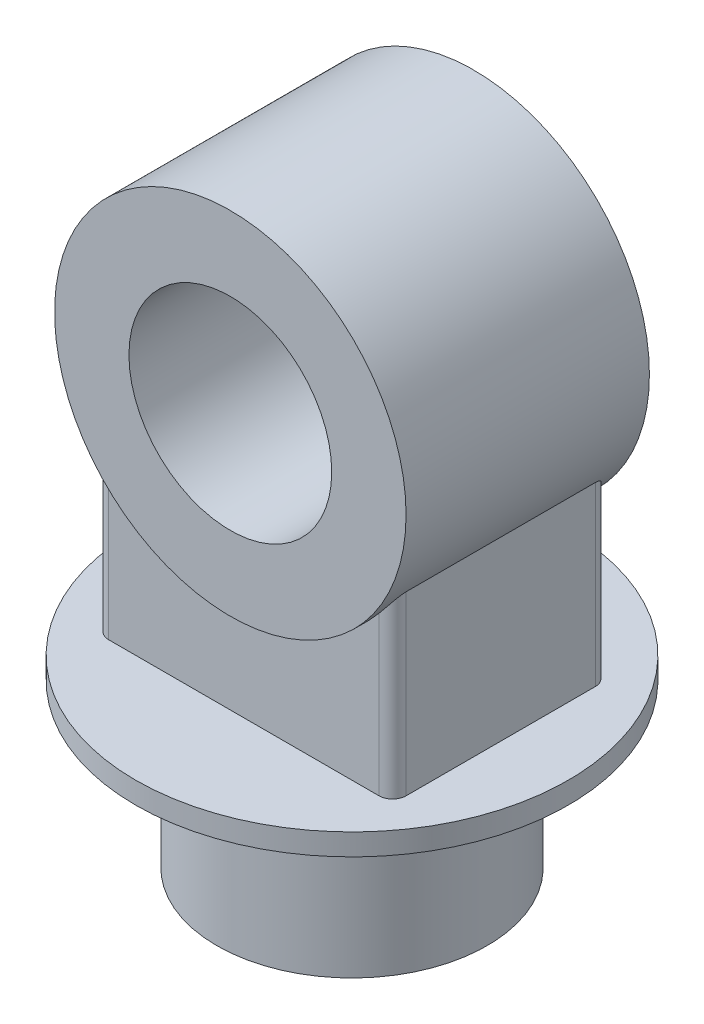
ISO-10303-21;
HEADER;
FILE_DESCRIPTION(('STEP AP214'),'2;1');
FILE_NAME('part.step','',(''),(''),'','','');
FILE_SCHEMA(('AUTOMOTIVE_DESIGN { 1 0 10303 214 1 1 1 1 }'));
ENDSEC;
DATA;
#1=APPLICATION_CONTEXT('core data for automotive mechanical design processes');
#2=APPLICATION_PROTOCOL_DEFINITION('international standard','automotive_design',2000,#1);
#3=PRODUCT_CONTEXT('',#1,'mechanical');
#4=PRODUCT('Part','Part','',(#3));
#5=PRODUCT_RELATED_PRODUCT_CATEGORY('part','',(#4));
#6=PRODUCT_DEFINITION_FORMATION('','',#4);
#7=PRODUCT_DEFINITION_CONTEXT('part definition',#1,'design');
#8=PRODUCT_DEFINITION('design','',#6,#7);
#9=PRODUCT_DEFINITION_SHAPE('','',#8);
#10=(LENGTH_UNIT() NAMED_UNIT(*) SI_UNIT(.MILLI.,.METRE.));
#11=(NAMED_UNIT(*) PLANE_ANGLE_UNIT() SI_UNIT($,.RADIAN.));
#12=(NAMED_UNIT(*) SI_UNIT($,.STERADIAN.) SOLID_ANGLE_UNIT());
#13=UNCERTAINTY_MEASURE_WITH_UNIT(LENGTH_MEASURE(1.E-05),#10,'distance_accuracy_value','');
#14=(GEOMETRIC_REPRESENTATION_CONTEXT(3) GLOBAL_UNCERTAINTY_ASSIGNED_CONTEXT((#13)) GLOBAL_UNIT_ASSIGNED_CONTEXT((#10,
#11,#12)) REPRESENTATION_CONTEXT('',''));
#15=CARTESIAN_POINT('',(0.,0.,0.));
#16=DIRECTION('',(0.,0.,1.));
#17=DIRECTION('',(1.,0.,0.));
#18=AXIS2_PLACEMENT_3D('',#15,#16,#17);
#19=CARTESIAN_POINT('',(0.,120.,0.));
#20=DIRECTION('',(0.,-1.,0.));
#21=DIRECTION('',(0.,0.,-1.));
#22=AXIS2_PLACEMENT_3D('',#19,#20,#21);
#23=CYLINDRICAL_SURFACE('',#22,100.);
#24=CARTESIAN_POINT('',(0.,120.,0.));
#25=DIRECTION('',(0.,1.,0.));
#26=DIRECTION('',(0.,0.,1.));
#27=AXIS2_PLACEMENT_3D('',#24,#25,#26);
#28=CIRCLE('',#27,100.);
#29=CARTESIAN_POINT('',(0.,120.,100.));
#30=VERTEX_POINT('',#29);
#31=EDGE_CURVE('E151',#30,#30,#28,.T.);
#32=ORIENTED_EDGE('',*,*,#31,.F.);
#33=EDGE_LOOP('',(#32));
#34=FACE_BOUND('',#33,.T.);
#35=CARTESIAN_POINT('',(0.,0.,0.));
#36=DIRECTION('',(0.,1.,0.));
#37=DIRECTION('',(0.,0.,1.));
#38=AXIS2_PLACEMENT_3D('',#35,#36,#37);
#39=CIRCLE('',#38,100.);
#40=CARTESIAN_POINT('',(0.,0.,100.));
#41=VERTEX_POINT('',#40);
#42=EDGE_CURVE('E236',#41,#41,#39,.T.);
#43=ORIENTED_EDGE('',*,*,#42,.T.);
#44=EDGE_LOOP('',(#43));
#45=FACE_BOUND('',#44,.T.);
#46=ADVANCED_FACE('F42',(#34,#45),#23,.T.);
#47=CARTESIAN_POINT('',(0.,0.,0.));
#48=DIRECTION('',(0.,1.,0.));
#49=DIRECTION('',(0.,0.,1.));
#50=AXIS2_PLACEMENT_3D('',#47,#48,#49);
#51=PLANE('',#50);
#52=ORIENTED_EDGE('',*,*,#42,.F.);
#53=EDGE_LOOP('',(#52));
#54=FACE_BOUND('',#53,.T.);
#55=ADVANCED_FACE('F247',(#54),#51,.F.);
#56=CARTESIAN_POINT('',(0.,136.,0.));
#57=DIRECTION('',(0.,-1.,0.));
#58=DIRECTION('',(0.,0.,-1.));
#59=AXIS2_PLACEMENT_3D('',#56,#57,#58);
#60=CYLINDRICAL_SURFACE('',#59,160.);
#61=CARTESIAN_POINT('',(0.,136.,0.));
#62=DIRECTION('',(0.,1.,0.));
#63=DIRECTION('',(0.,0.,1.));
#64=AXIS2_PLACEMENT_3D('',#61,#62,#63);
#65=CIRCLE('',#64,160.);
#66=CARTESIAN_POINT('',(0.,136.,160.));
#67=VERTEX_POINT('',#66);
#68=EDGE_CURVE('E232',#67,#67,#65,.T.);
#69=ORIENTED_EDGE('',*,*,#68,.F.);
#70=EDGE_LOOP('',(#69));
#71=FACE_BOUND('',#70,.T.);
#72=CARTESIAN_POINT('',(0.,120.,0.));
#73=DIRECTION('',(0.,1.,0.));
#74=DIRECTION('',(0.,0.,1.));
#75=AXIS2_PLACEMENT_3D('',#72,#73,#74);
#76=CIRCLE('',#75,160.);
#77=CARTESIAN_POINT('',(0.,120.,160.));
#78=VERTEX_POINT('',#77);
#79=EDGE_CURVE('E227',#78,#78,#76,.T.);
#80=ORIENTED_EDGE('',*,*,#79,.T.);
#81=EDGE_LOOP('',(#80));
#82=FACE_BOUND('',#81,.T.);
#83=ADVANCED_FACE('F249',(#71,#82),#60,.T.);
#84=CARTESIAN_POINT('',(0.,136.,0.));
#85=DIRECTION('',(0.,1.,0.));
#86=DIRECTION('',(0.,0.,1.));
#87=AXIS2_PLACEMENT_3D('',#84,#85,#86);
#88=PLANE('',#87);
#89=DIRECTION('',(0.,0.,1.));
#90=VECTOR('',#89,1.);
#91=CARTESIAN_POINT('',(-110.,136.,80.));
#92=LINE('',#91,#90);
#93=CARTESIAN_POINT('',(-110.,136.,-70.));
#94=VERTEX_POINT('',#93);
#95=CARTESIAN_POINT('',(-110.,136.,70.));
#96=VERTEX_POINT('',#95);
#97=EDGE_CURVE('E416',#94,#96,#92,.T.);
#98=ORIENTED_EDGE('',*,*,#97,.F.);
#99=CARTESIAN_POINT('',(-100.,136.,-70.));
#100=DIRECTION('',(0.,1.,0.));
#101=DIRECTION('',(0.,0.,1.));
#102=AXIS2_PLACEMENT_3D('',#99,#100,#101);
#103=CIRCLE('',#102,10.);
#104=CARTESIAN_POINT('',(-100.,136.,-80.));
#105=VERTEX_POINT('',#104);
#106=EDGE_CURVE('E127',#94,#105,#103,.F.);
#107=ORIENTED_EDGE('',*,*,#106,.T.);
#108=DIRECTION('',(-1.,0.,0.));
#109=VECTOR('',#108,1.);
#110=CARTESIAN_POINT('',(110.,136.,-80.));
#111=LINE('',#110,#109);
#112=CARTESIAN_POINT('',(100.,136.,-80.));
#113=VERTEX_POINT('',#112);
#114=EDGE_CURVE('E413',#113,#105,#111,.T.);
#115=ORIENTED_EDGE('',*,*,#114,.F.);
#116=CARTESIAN_POINT('',(100.,136.,-70.));
#117=DIRECTION('',(0.,1.,0.));
#118=DIRECTION('',(0.,0.,1.));
#119=AXIS2_PLACEMENT_3D('',#116,#117,#118);
#120=CIRCLE('',#119,10.);
#121=CARTESIAN_POINT('',(110.,136.,-70.));
#122=VERTEX_POINT('',#121);
#123=EDGE_CURVE('E64',#113,#122,#120,.F.);
#124=ORIENTED_EDGE('',*,*,#123,.T.);
#125=DIRECTION('',(0.,0.,-1.));
#126=VECTOR('',#125,1.);
#127=CARTESIAN_POINT('',(110.,136.,80.));
#128=LINE('',#127,#126);
#129=CARTESIAN_POINT('',(110.,136.,70.));
#130=VERTEX_POINT('',#129);
#131=EDGE_CURVE('E213',#130,#122,#128,.T.);
#132=ORIENTED_EDGE('',*,*,#131,.F.);
#133=CARTESIAN_POINT('',(100.,136.,70.));
#134=DIRECTION('',(0.,1.,0.));
#135=DIRECTION('',(0.,0.,1.));
#136=AXIS2_PLACEMENT_3D('',#133,#134,#135);
#137=CIRCLE('',#136,10.);
#138=CARTESIAN_POINT('',(100.,136.,80.));
#139=VERTEX_POINT('',#138);
#140=EDGE_CURVE('E57',#130,#139,#137,.F.);
#141=ORIENTED_EDGE('',*,*,#140,.T.);
#142=DIRECTION('',(1.,0.,0.));
#143=VECTOR('',#142,1.);
#144=CARTESIAN_POINT('',(110.,136.,80.));
#145=LINE('',#144,#143);
#146=CARTESIAN_POINT('',(-100.,136.,80.));
#147=VERTEX_POINT('',#146);
#148=EDGE_CURVE('E212',#147,#139,#145,.T.);
#149=ORIENTED_EDGE('',*,*,#148,.F.);
#150=CARTESIAN_POINT('',(-100.,136.,70.));
#151=DIRECTION('',(0.,1.,0.));
#152=DIRECTION('',(0.,0.,1.));
#153=AXIS2_PLACEMENT_3D('',#150,#151,#152);
#154=CIRCLE('',#153,10.);
#155=EDGE_CURVE('E128',#147,#96,#154,.F.);
#156=ORIENTED_EDGE('',*,*,#155,.T.);
#157=EDGE_LOOP('',(#98,#107,#115,#124,#132,#141,#149,#156));
#158=FACE_BOUND('',#157,.T.);
#159=ORIENTED_EDGE('',*,*,#68,.T.);
#160=EDGE_LOOP('',(#159));
#161=FACE_BOUND('',#160,.T.);
#162=ADVANCED_FACE('F210',(#158,#161),#88,.T.);
#163=CARTESIAN_POINT('',(0.,120.,0.));
#164=DIRECTION('',(0.,1.,0.));
#165=DIRECTION('',(0.,0.,1.));
#166=AXIS2_PLACEMENT_3D('',#163,#164,#165);
#167=PLANE('',#166);
#168=ORIENTED_EDGE('',*,*,#31,.T.);
#169=EDGE_LOOP('',(#168));
#170=FACE_BOUND('',#169,.T.);
#171=ORIENTED_EDGE('',*,*,#79,.F.);
#172=EDGE_LOOP('',(#171));
#173=FACE_BOUND('',#172,.T.);
#174=ADVANCED_FACE('F258',(#170,#173),#167,.F.);
#175=CARTESIAN_POINT('',(110.,466.002,80.));
#176=DIRECTION('',(0.,0.,-1.));
#177=DIRECTION('',(-1.,0.,0.));
#178=AXIS2_PLACEMENT_3D('',#175,#176,#177);
#179=PLANE('',#178);
#180=CARTESIAN_POINT('',(0.,336.,80.));
#181=DIRECTION('',(0.,0.,-1.));
#182=DIRECTION('',(-1.,0.,0.));
#183=AXIS2_PLACEMENT_3D('',#180,#181,#182);
#184=CIRCLE('',#183,130.);
#185=CARTESIAN_POINT('',(-100.,252.933761370819,80.));
#186=VERTEX_POINT('',#185);
#187=CARTESIAN_POINT('',(100.,252.933761370819,80.));
#188=VERTEX_POINT('',#187);
#189=EDGE_CURVE('E119',#186,#188,#184,.F.);
#190=ORIENTED_EDGE('',*,*,#189,.F.);
#191=DIRECTION('',(0.,-1.,0.));
#192=VECTOR('',#191,1.);
#193=CARTESIAN_POINT('',(-100.,466.002,80.));
#194=LINE('',#193,#192);
#195=EDGE_CURVE('E134',#186,#147,#194,.T.);
#196=ORIENTED_EDGE('',*,*,#195,.T.);
#197=ORIENTED_EDGE('',*,*,#148,.T.);
#198=DIRECTION('',(0.,-1.,0.));
#199=VECTOR('',#198,1.);
#200=CARTESIAN_POINT('',(100.,466.002,80.));
#201=LINE('',#200,#199);
#202=EDGE_CURVE('E136',#139,#188,#201,.F.);
#203=ORIENTED_EDGE('',*,*,#202,.T.);
#204=EDGE_LOOP('',(#190,#196,#197,#203));
#205=FACE_BOUND('',#204,.T.);
#206=ADVANCED_FACE('F132',(#205),#179,.F.);
#207=CARTESIAN_POINT('',(-110.,466.002,80.));
#208=DIRECTION('',(1.,0.,0.));
#209=DIRECTION('',(0.,0.,-1.));
#210=AXIS2_PLACEMENT_3D('',#207,#208,#209);
#211=PLANE('',#210);
#212=ORIENTED_EDGE('',*,*,#97,.T.);
#213=DIRECTION('',(0.,-1.,0.));
#214=VECTOR('',#213,1.);
#215=CARTESIAN_POINT('',(-110.,466.002,70.));
#216=LINE('',#215,#214);
#217=CARTESIAN_POINT('',(-110.,266.717967697245,70.));
#218=VERTEX_POINT('',#217);
#219=EDGE_CURVE('E148',#96,#218,#216,.F.);
#220=ORIENTED_EDGE('',*,*,#219,.T.);
#221=DIRECTION('',(0.,0.,-1.));
#222=VECTOR('',#221,1.);
#223=CARTESIAN_POINT('',(-110.,266.717967697245,90.));
#224=LINE('',#223,#222);
#225=CARTESIAN_POINT('',(-110.,266.717967697245,-70.));
#226=VERTEX_POINT('',#225);
#227=EDGE_CURVE('E122',#226,#218,#224,.F.);
#228=ORIENTED_EDGE('',*,*,#227,.F.);
#229=DIRECTION('',(0.,-1.,0.));
#230=VECTOR('',#229,1.);
#231=CARTESIAN_POINT('',(-110.,466.002,-70.));
#232=LINE('',#231,#230);
#233=EDGE_CURVE('E142',#226,#94,#232,.T.);
#234=ORIENTED_EDGE('',*,*,#233,.T.);
#235=EDGE_LOOP('',(#212,#220,#228,#234));
#236=FACE_BOUND('',#235,.T.);
#237=ADVANCED_FACE('F264',(#236),#211,.F.);
#238=CARTESIAN_POINT('',(110.,466.002,80.));
#239=DIRECTION('',(-1.,0.,0.));
#240=DIRECTION('',(0.,0.,1.));
#241=AXIS2_PLACEMENT_3D('',#238,#239,#240);
#242=PLANE('',#241);
#243=ORIENTED_EDGE('',*,*,#131,.T.);
#244=DIRECTION('',(0.,-1.,0.));
#245=VECTOR('',#244,1.);
#246=CARTESIAN_POINT('',(110.,466.002,-70.));
#247=LINE('',#246,#245);
#248=CARTESIAN_POINT('',(110.,266.717967697245,-70.));
#249=VERTEX_POINT('',#248);
#250=EDGE_CURVE('E167',#122,#249,#247,.F.);
#251=ORIENTED_EDGE('',*,*,#250,.T.);
#252=DIRECTION('',(0.,0.,-1.));
#253=VECTOR('',#252,1.);
#254=CARTESIAN_POINT('',(110.,266.717967697245,90.));
#255=LINE('',#254,#253);
#256=CARTESIAN_POINT('',(110.,266.717967697245,70.));
#257=VERTEX_POINT('',#256);
#258=EDGE_CURVE('E138',#257,#249,#255,.T.);
#259=ORIENTED_EDGE('',*,*,#258,.F.);
#260=DIRECTION('',(0.,-1.,0.));
#261=VECTOR('',#260,1.);
#262=CARTESIAN_POINT('',(110.,466.002,70.));
#263=LINE('',#262,#261);
#264=EDGE_CURVE('E164',#257,#130,#263,.T.);
#265=ORIENTED_EDGE('',*,*,#264,.T.);
#266=EDGE_LOOP('',(#243,#251,#259,#265));
#267=FACE_BOUND('',#266,.T.);
#268=ADVANCED_FACE('F220',(#267),#242,.F.);
#269=CARTESIAN_POINT('',(110.,466.002,-80.));
#270=DIRECTION('',(0.,0.,1.));
#271=DIRECTION('',(1.,0.,0.));
#272=AXIS2_PLACEMENT_3D('',#269,#270,#271);
#273=PLANE('',#272);
#274=ORIENTED_EDGE('',*,*,#114,.T.);
#275=DIRECTION('',(0.,-1.,0.));
#276=VECTOR('',#275,1.);
#277=CARTESIAN_POINT('',(-100.,466.002,-80.));
#278=LINE('',#277,#276);
#279=CARTESIAN_POINT('',(-100.,252.933761370819,-80.));
#280=VERTEX_POINT('',#279);
#281=EDGE_CURVE('E161',#105,#280,#278,.F.);
#282=ORIENTED_EDGE('',*,*,#281,.T.);
#283=CARTESIAN_POINT('',(0.,336.,-80.));
#284=DIRECTION('',(0.,0.,1.));
#285=DIRECTION('',(1.,0.,0.));
#286=AXIS2_PLACEMENT_3D('',#283,#284,#285);
#287=CIRCLE('',#286,130.);
#288=CARTESIAN_POINT('',(100.,252.933761370819,-80.));
#289=VERTEX_POINT('',#288);
#290=EDGE_CURVE('E223',#289,#280,#287,.F.);
#291=ORIENTED_EDGE('',*,*,#290,.F.);
#292=DIRECTION('',(0.,-1.,0.));
#293=VECTOR('',#292,1.);
#294=CARTESIAN_POINT('',(100.,466.002,-80.));
#295=LINE('',#294,#293);
#296=EDGE_CURVE('E157',#289,#113,#295,.T.);
#297=ORIENTED_EDGE('',*,*,#296,.T.);
#298=EDGE_LOOP('',(#274,#282,#291,#297));
#299=FACE_BOUND('',#298,.T.);
#300=ADVANCED_FACE('F268',(#299),#273,.F.);
#301=CARTESIAN_POINT('',(0.,336.,90.));
#302=DIRECTION('',(0.,0.,-1.));
#303=DIRECTION('',(-1.,0.,0.));
#304=AXIS2_PLACEMENT_3D('',#301,#302,#303);
#305=CYLINDRICAL_SURFACE('',#304,130.);
#306=CARTESIAN_POINT('',(0.,336.,90.));
#307=DIRECTION('',(0.,0.,1.));
#308=DIRECTION('',(1.,0.,0.));
#309=AXIS2_PLACEMENT_3D('',#306,#307,#308);
#310=CIRCLE('',#309,130.);
#311=CARTESIAN_POINT('',(130.,336.,90.));
#312=VERTEX_POINT('',#311);
#313=EDGE_CURVE('E417',#312,#312,#310,.T.);
#314=ORIENTED_EDGE('',*,*,#313,.F.);
#315=EDGE_LOOP('',(#314));
#316=FACE_BOUND('',#315,.T.);
#317=CARTESIAN_POINT('',(0.,336.,-90.));
#318=DIRECTION('',(0.,0.,1.));
#319=DIRECTION('',(1.,0.,0.));
#320=AXIS2_PLACEMENT_3D('',#317,#318,#319);
#321=CIRCLE('',#320,130.);
#322=CARTESIAN_POINT('',(130.,336.,-90.));
#323=VERTEX_POINT('',#322);
#324=EDGE_CURVE('E423',#323,#323,#321,.T.);
#325=ORIENTED_EDGE('',*,*,#324,.T.);
#326=EDGE_LOOP('',(#325));
#327=FACE_BOUND('',#326,.T.);
#328=ORIENTED_EDGE('',*,*,#290,.T.);
#329=CARTESIAN_POINT('',(-100.,252.933761370819,-80.));
#330=CARTESIAN_POINT('',(-100.223611151915,253.202952503255,-79.9999830665315));
#331=CARTESIAN_POINT('',(-100.446118360057,253.473036166024,-79.9924995885085));
#332=CARTESIAN_POINT('',(-100.888548742496,254.014496760122,-79.9629173131463));
#333=CARTESIAN_POINT('',(-101.108472043759,254.285873626978,-79.9408192370116));
#334=CARTESIAN_POINT('',(-101.545586290072,254.829711400373,-79.8822979337703));
#335=CARTESIAN_POINT('',(-101.76277446753,255.102173087004,-79.8458612385231));
#336=CARTESIAN_POINT('',(-102.193849033468,255.647413797012,-79.7588609087488));
#337=CARTESIAN_POINT('',(-102.407735374993,255.920192824843,-79.7082970735217));
#338=CARTESIAN_POINT('',(-103.048408055095,256.74400885936,-79.5343891784366));
#339=CARTESIAN_POINT('',(-103.469748368072,257.294974230618,-79.3894263280958));
#340=CARTESIAN_POINT('',(-104.088382224678,258.117224843771,-79.1288060997197));
#341=CARTESIAN_POINT('',(-104.292337034927,258.39057162742,-79.0347525474724));
#342=CARTESIAN_POINT('',(-104.695498702643,258.935304765081,-78.8319429710982));
#343=CARTESIAN_POINT('',(-104.894706004332,259.206691300842,-78.7231883289499));
#344=CARTESIAN_POINT('',(-105.336170271764,259.812965668139,-78.4620472638272));
#345=CARTESIAN_POINT('',(-105.577006541077,260.147108038148,-78.3055009036513));
#346=CARTESIAN_POINT('',(-106.04966094987,260.809343252621,-77.967808626391));
#347=CARTESIAN_POINT('',(-106.281479043935,261.137436066616,-77.7866625854444));
#348=CARTESIAN_POINT('',(-106.734152264033,261.784259610706,-77.3986376161628));
#349=CARTESIAN_POINT('',(-106.955036134368,262.103013877598,-77.1918317878757));
#350=CARTESIAN_POINT('',(-107.384708325122,262.728803605627,-76.749894392022));
#351=CARTESIAN_POINT('',(-107.593501627276,263.035843875289,-76.5147746155492));
#352=CARTESIAN_POINT('',(-107.921279015409,263.522080966667,-76.1068757916446));
#353=CARTESIAN_POINT('',(-108.044709884718,263.706240813682,-75.9435605188263));
#354=CARTESIAN_POINT('',(-108.284949666933,264.066582834907,-75.6038296157538));
#355=CARTESIAN_POINT('',(-108.401760304956,264.242767084986,-75.4274174262628));
#356=CARTESIAN_POINT('',(-108.627683741988,264.585236991633,-75.0605773993746));
#357=CARTESIAN_POINT('',(-108.736797961361,264.751524473746,-74.8701521613912));
#358=CARTESIAN_POINT('',(-108.945874410432,265.071634412635,-74.4745306992528));
#359=CARTESIAN_POINT('',(-109.04583974995,265.225461102935,-74.2693395369045));
#360=CARTESIAN_POINT('',(-109.274660386151,265.579056080623,-73.7536743100227));
#361=CARTESIAN_POINT('',(-109.398046362816,265.771031349643,-73.4351396850742));
#362=CARTESIAN_POINT('',(-109.561336457207,266.026263049992,-72.9345418523035));
#363=CARTESIAN_POINT('',(-109.612072269395,266.105785634321,-72.7641622498836));
#364=CARTESIAN_POINT('',(-109.705421847597,266.25239837099,-72.4160328323222));
#365=CARTESIAN_POINT('',(-109.748040656091,266.319496241142,-72.2382876769632));
#366=CARTESIAN_POINT('',(-109.820262744001,266.433384610412,-71.8947331689276));
#367=CARTESIAN_POINT('',(-109.850752312767,266.481551609067,-71.729567610939));
#368=CARTESIAN_POINT('',(-109.903691363628,266.565274678988,-71.3948451418076));
#369=CARTESIAN_POINT('',(-109.926143541964,266.600834979285,-71.2252897238033));
#370=CARTESIAN_POINT('',(-109.962659042777,266.658707696818,-70.8807814271977));
#371=CARTESIAN_POINT('',(-109.976613864032,266.680848750137,-70.7057875562757));
#372=CARTESIAN_POINT('',(-109.99061964662,266.703076138542,-70.4419386674803));
#373=CARTESIAN_POINT('',(-109.99413386492,266.708654625171,-70.3536902139711));
#374=CARTESIAN_POINT('',(-109.998824989492,266.716102079046,-70.1769662160102));
#375=CARTESIAN_POINT('',(-110.000001659485,266.717970671296,-70.088490649507));
#376=CARTESIAN_POINT('',(-110.,266.717967697245,-70.));
#377=B_SPLINE_CURVE_WITH_KNOTS('',3,(#329,#330,#331,#332,#333,#334,#335,#336,#337,#338,#339,
#340,#341,#342,#343,#344,#345,#346,#347,#348,#349,#350,#351,#352,#353,#354,#355,#356,#357,#358,
#359,#360,#361,#362,#363,#364,#365,#366,#367,#368,#369,#370,#371,#372,#373,#374,#375,#376),
.UNSPECIFIED.,.F.,.F.,(4,2,2,2,2,2,2,2,2,2,2,2,2,2,2,2,2,2,2,2,2,2,2,4),(0.,1.04974156507777,
2.09943133114568,3.1501094241726,4.20080244462026,6.32356278933854,7.38465211465329,
8.44564176134495,9.7667768553939,11.0879186017609,12.4053795382948,13.7222937149076,
14.5479419827464,15.3733741023698,16.1986534888326,17.023651302289,18.194686650492,
18.7783719827905,19.3616935243415,19.8852298594992,20.4085904030381,20.9385006934629,
21.2038887699912,21.4693036704869),.UNSPECIFIED.);
#378=EDGE_CURVE('E193',#280,#226,#377,.T.);
#379=ORIENTED_EDGE('',*,*,#378,.T.);
#380=ORIENTED_EDGE('',*,*,#227,.T.);
#381=CARTESIAN_POINT('',(-110.,266.717967697245,70.));
#382=CARTESIAN_POINT('',(-110.000033683462,266.718025852698,70.1614230595313));
#383=CARTESIAN_POINT('',(-109.996092792414,266.711764254296,70.3228118197691));
#384=CARTESIAN_POINT('',(-109.980519982779,266.687045880384,70.6441123999958));
#385=CARTESIAN_POINT('',(-109.968896213713,266.668602027069,70.8040256031146));
#386=CARTESIAN_POINT('',(-109.938376398954,266.620217986395,71.1196424551221));
#387=CARTESIAN_POINT('',(-109.919558261622,266.590400967593,71.2753727040436));
#388=CARTESIAN_POINT('',(-109.875071558334,266.52000006118,71.5834085562726));
#389=CARTESIAN_POINT('',(-109.849400846184,266.479412800404,71.7357130704249));
#390=CARTESIAN_POINT('',(-109.784772267017,266.377386983169,72.0722520040974));
#391=CARTESIAN_POINT('',(-109.744103525393,266.313281105856,72.2553511890568));
#392=CARTESIAN_POINT('',(-109.654040532803,266.17165023193,72.6141464391851));
#393=CARTESIAN_POINT('',(-109.604640075501,266.094115691273,72.7898371277865));
#394=CARTESIAN_POINT('',(-109.497968805892,265.927147418338,73.1338723913451));
#395=CARTESIAN_POINT('',(-109.440667457039,265.837667562915,73.3021849515411));
#396=CARTESIAN_POINT('',(-109.319341126161,265.648779195145,73.6304969218558));
#397=CARTESIAN_POINT('',(-109.25531768694,265.549372961282,73.7904982269664));
#398=CARTESIAN_POINT('',(-109.085069343255,265.28590129292,74.1868876463209));
#399=CARTESIAN_POINT('',(-108.974781990569,265.115997241409,74.4176642111939));
#400=CARTESIAN_POINT('',(-108.742772943656,264.76058359918,74.8607110351427));
#401=CARTESIAN_POINT('',(-108.621044869784,264.575065307649,75.072970840064));
#402=CARTESIAN_POINT('',(-108.36794946479,264.19164129378,75.4804206329535));
#403=CARTESIAN_POINT('',(-108.236568322626,263.993717884812,75.6755852518652));
#404=CARTESIAN_POINT('',(-107.965814499919,263.588382733388,76.0497203250662));
#405=CARTESIAN_POINT('',(-107.826442440892,263.380971729107,76.2286920360201));
#406=CARTESIAN_POINT('',(-107.56145650763,262.989174407744,76.5468161797372));
#407=CARTESIAN_POINT('',(-107.436764821801,262.805791987749,76.6879854690674));
#408=CARTESIAN_POINT('',(-107.182869679799,262.434497987953,76.9599552926783));
#409=CARTESIAN_POINT('',(-107.053665586411,262.24658576965,77.0907543539386));
#410=CARTESIAN_POINT('',(-106.659844344167,261.677121003612,77.4685356621902));
#411=CARTESIAN_POINT('',(-106.389102445143,261.289965080353,77.7008024816961));
#412=CARTESIAN_POINT('',(-105.833418194947,260.504836154638,78.129863631631));
#413=CARTESIAN_POINT('',(-105.548442441802,260.106838810795,78.3265689888296));
#414=CARTESIAN_POINT('',(-104.96676628824,259.304344779382,78.6860846955171));
#415=CARTESIAN_POINT('',(-104.670068038633,258.899849292081,78.8489012287858));
#416=CARTESIAN_POINT('',(-104.024574509401,258.030646711215,79.1623550419402));
#417=CARTESIAN_POINT('',(-103.674248758637,257.565348460988,79.3081944572228));
#418=CARTESIAN_POINT('',(-102.961876677953,256.632523338709,79.558756520093));
#419=CARTESIAN_POINT('',(-102.599828734006,256.16499616738,79.6634734792563));
#420=CARTESIAN_POINT('',(-102.051092736822,255.466397204689,79.7891645729388));
#421=CARTESIAN_POINT('',(-101.868137468165,255.235094848973,79.8257282191265));
#422=CARTESIAN_POINT('',(-101.499966150616,254.77288550036,79.8886289353229));
#423=CARTESIAN_POINT('',(-101.314750133026,254.541978502041,79.9149661467555));
#424=CARTESIAN_POINT('',(-100.942320486513,254.080919722901,79.9572665465168));
#425=CARTESIAN_POINT('',(-100.755107350153,253.850767773367,79.9732322353467));
#426=CARTESIAN_POINT('',(-100.378860262163,253.391449185777,79.9945948234744));
#427=CARTESIAN_POINT('',(-100.189826234412,253.162282589497,79.9999912789888));
#428=CARTESIAN_POINT('',(-100.,252.933761370819,80.));
#429=B_SPLINE_CURVE_WITH_KNOTS('',3,(#381,#382,#383,#384,#385,#386,#387,#388,#389,#390,#391,
#392,#393,#394,#395,#396,#397,#398,#399,#400,#401,#402,#403,#404,#405,#406,#407,#408,#409,#410,
#411,#412,#413,#414,#415,#416,#417,#418,#419,#420,#421,#422,#423,#424,#425,#426,#427,#428),
.UNSPECIFIED.,.F.,.F.,(4,2,2,2,2,2,2,2,2,2,2,2,2,2,2,2,2,2,2,2,2,2,2,4),(0.,0.484045005923086,
0.967577389145422,1.44601544684507,1.92460352520313,2.51835043890468,3.11252108624077,
3.70905613988741,4.30545457926274,5.22516595363374,6.14539326092329,7.06696382284191,
7.98846280401962,8.7768009200054,9.56525081419893,11.1426900482287,12.7240229357797,
14.305067020047,16.1047501551828,17.9046821508918,18.7960435003638,19.6873925225409,
20.5785265668947,21.4696980275819),.UNSPECIFIED.);
#430=EDGE_CURVE('E115',#218,#186,#429,.T.);
#431=ORIENTED_EDGE('',*,*,#430,.T.);
#432=ORIENTED_EDGE('',*,*,#189,.T.);
#433=CARTESIAN_POINT('',(100.,252.933761370819,80.));
#434=CARTESIAN_POINT('',(100.223611151915,253.202952503255,79.9999830665315));
#435=CARTESIAN_POINT('',(100.446118360057,253.473036166024,79.9924995885084));
#436=CARTESIAN_POINT('',(100.888548742496,254.014496760122,79.9629173131463));
#437=CARTESIAN_POINT('',(101.108472043759,254.285873626978,79.9408192370115));
#438=CARTESIAN_POINT('',(101.545586290072,254.829711400373,79.8822979337703));
#439=CARTESIAN_POINT('',(101.76277446753,255.102173087004,79.8458612385231));
#440=CARTESIAN_POINT('',(102.193849033468,255.647413797012,79.7588609087488));
#441=CARTESIAN_POINT('',(102.407735374993,255.920192824843,79.7082970735217));
#442=CARTESIAN_POINT('',(103.048408055095,256.74400885936,79.5343891784366));
#443=CARTESIAN_POINT('',(103.469748368072,257.294974230618,79.3894263280957));
#444=CARTESIAN_POINT('',(104.088382224678,258.117224843771,79.1288060997197));
#445=CARTESIAN_POINT('',(104.292337034927,258.39057162742,79.0347525474724));
#446=CARTESIAN_POINT('',(104.695498702643,258.935304765081,78.8319429710981));
#447=CARTESIAN_POINT('',(104.894706004332,259.206691300842,78.7231883289499));
#448=CARTESIAN_POINT('',(105.336170271764,259.812965668139,78.4620472638272));
#449=CARTESIAN_POINT('',(105.577006541077,260.147108038148,78.3055009036513));
#450=CARTESIAN_POINT('',(106.04966094987,260.809343252621,77.967808626391));
#451=CARTESIAN_POINT('',(106.281479043935,261.137436066616,77.7866625854443));
#452=CARTESIAN_POINT('',(106.734152264033,261.784259610706,77.3986376161628));
#453=CARTESIAN_POINT('',(106.955036134368,262.103013877598,77.1918317878757));
#454=CARTESIAN_POINT('',(107.384708325122,262.728803605627,76.749894392022));
#455=CARTESIAN_POINT('',(107.593501627276,263.035843875289,76.5147746155492));
#456=CARTESIAN_POINT('',(107.921279015409,263.522080966666,76.1068757916445));
#457=CARTESIAN_POINT('',(108.044709884718,263.706240813682,75.9435605188263));
#458=CARTESIAN_POINT('',(108.284949666933,264.066582834907,75.6038296157538));
#459=CARTESIAN_POINT('',(108.401760304956,264.242767084986,75.4274174262629));
#460=CARTESIAN_POINT('',(108.627683741988,264.585236991633,75.0605773993746));
#461=CARTESIAN_POINT('',(108.736797961361,264.751524473746,74.8701521613912));
#462=CARTESIAN_POINT('',(108.945874410432,265.071634412635,74.4745306992527));
#463=CARTESIAN_POINT('',(109.04583974995,265.225461102935,74.2693395369045));
#464=CARTESIAN_POINT('',(109.274660386151,265.579056080623,73.7536743100227));
#465=CARTESIAN_POINT('',(109.398046362816,265.771031349643,73.4351396850742));
#466=CARTESIAN_POINT('',(109.561336457207,266.026263049992,72.9345418523035));
#467=CARTESIAN_POINT('',(109.612072269395,266.105785634321,72.7641622498837));
#468=CARTESIAN_POINT('',(109.705421847597,266.25239837099,72.4160328323222));
#469=CARTESIAN_POINT('',(109.748040656091,266.319496241142,72.2382876769633));
#470=CARTESIAN_POINT('',(109.820262744001,266.433384610412,71.8947331689276));
#471=CARTESIAN_POINT('',(109.850752312767,266.481551609067,71.729567610939));
#472=CARTESIAN_POINT('',(109.903691363628,266.565274678987,71.3948451418076));
#473=CARTESIAN_POINT('',(109.926143541964,266.600834979285,71.2252897238033));
#474=CARTESIAN_POINT('',(109.962659042777,266.658707696818,70.8807814271977));
#475=CARTESIAN_POINT('',(109.976613864032,266.680848750137,70.7057875562757));
#476=CARTESIAN_POINT('',(109.99061964662,266.703076138542,70.4419386674803));
#477=CARTESIAN_POINT('',(109.99413386492,266.708654625171,70.3536902139711));
#478=CARTESIAN_POINT('',(109.998824989492,266.716102079046,70.1769662160102));
#479=CARTESIAN_POINT('',(110.000001659485,266.717970671296,70.088490649507));
#480=CARTESIAN_POINT('',(110.,266.717967697245,70.));
#481=B_SPLINE_CURVE_WITH_KNOTS('',3,(#433,#434,#435,#436,#437,#438,#439,#440,#441,#442,#443,
#444,#445,#446,#447,#448,#449,#450,#451,#452,#453,#454,#455,#456,#457,#458,#459,#460,#461,#462,
#463,#464,#465,#466,#467,#468,#469,#470,#471,#472,#473,#474,#475,#476,#477,#478,#479,#480),
.UNSPECIFIED.,.F.,.F.,(4,2,2,2,2,2,2,2,2,2,2,2,2,2,2,2,2,2,2,2,2,2,2,4),(0.,1.04974156507782,
2.09943133114566,3.15010942417265,4.20080244462031,6.3235627893386,7.38465211465333,
8.44564176134499,9.76677685539395,11.087918601761,12.4053795382948,13.7222937149077,
14.5479419827464,15.3733741023698,16.1986534888326,17.023651302289,18.194686650492,
18.7783719827905,19.3616935243415,19.8852298594992,20.408590403038,20.9385006934629,
21.2038887699912,21.4693036704869),.UNSPECIFIED.);
#482=EDGE_CURVE('E11',#188,#257,#481,.T.);
#483=ORIENTED_EDGE('',*,*,#482,.T.);
#484=ORIENTED_EDGE('',*,*,#258,.T.);
#485=CARTESIAN_POINT('',(110.,266.717967697245,-70.));
#486=CARTESIAN_POINT('',(110.000033683462,266.718025852698,-70.1614230595314));
#487=CARTESIAN_POINT('',(109.996092792414,266.711764254296,-70.3228118197691));
#488=CARTESIAN_POINT('',(109.980519982779,266.687045880384,-70.6441123999958));
#489=CARTESIAN_POINT('',(109.968896213713,266.668602027069,-70.8040256031146));
#490=CARTESIAN_POINT('',(109.938376398954,266.620217986395,-71.1196424551221));
#491=CARTESIAN_POINT('',(109.919558261622,266.590400967593,-71.2753727040436));
#492=CARTESIAN_POINT('',(109.875071558334,266.52000006118,-71.5834085562727));
#493=CARTESIAN_POINT('',(109.849400846184,266.479412800404,-71.735713070425));
#494=CARTESIAN_POINT('',(109.784772267017,266.377386983169,-72.0722520040975));
#495=CARTESIAN_POINT('',(109.744103525393,266.313281105856,-72.2553511890569));
#496=CARTESIAN_POINT('',(109.654040532803,266.17165023193,-72.6141464391851));
#497=CARTESIAN_POINT('',(109.604640075501,266.094115691273,-72.7898371277865));
#498=CARTESIAN_POINT('',(109.497968805892,265.927147418338,-73.1338723913451));
#499=CARTESIAN_POINT('',(109.440667457039,265.837667562915,-73.3021849515411));
#500=CARTESIAN_POINT('',(109.319341126161,265.648779195145,-73.6304969218559));
#501=CARTESIAN_POINT('',(109.25531768694,265.549372961282,-73.7904982269664));
#502=CARTESIAN_POINT('',(109.085069343255,265.28590129292,-74.1868876463209));
#503=CARTESIAN_POINT('',(108.974781990569,265.115997241409,-74.4176642111939));
#504=CARTESIAN_POINT('',(108.742772943656,264.76058359918,-74.8607110351427));
#505=CARTESIAN_POINT('',(108.621044869784,264.575065307649,-75.0729708400641));
#506=CARTESIAN_POINT('',(108.36794946479,264.19164129378,-75.4804206329535));
#507=CARTESIAN_POINT('',(108.236568322626,263.993717884812,-75.6755852518653));
#508=CARTESIAN_POINT('',(107.965814499919,263.588382733387,-76.0497203250662));
#509=CARTESIAN_POINT('',(107.826442440892,263.380971729107,-76.2286920360202));
#510=CARTESIAN_POINT('',(107.56145650763,262.989174407744,-76.5468161797373));
#511=CARTESIAN_POINT('',(107.436764821801,262.805791987749,-76.6879854690674));
#512=CARTESIAN_POINT('',(107.182869679799,262.434497987953,-76.9599552926784));
#513=CARTESIAN_POINT('',(107.053665586411,262.24658576965,-77.0907543539386));
#514=CARTESIAN_POINT('',(106.659844344167,261.677121003612,-77.4685356621902));
#515=CARTESIAN_POINT('',(106.389102445143,261.289965080353,-77.7008024816961));
#516=CARTESIAN_POINT('',(105.833418194947,260.504836154638,-78.129863631631));
#517=CARTESIAN_POINT('',(105.548442441802,260.106838810795,-78.3265689888296));
#518=CARTESIAN_POINT('',(104.96676628824,259.304344779382,-78.6860846955172));
#519=CARTESIAN_POINT('',(104.670068038633,258.899849292081,-78.8489012287859));
#520=CARTESIAN_POINT('',(104.024574509401,258.030646711215,-79.1623550419403));
#521=CARTESIAN_POINT('',(103.674248758637,257.565348460988,-79.3081944572229));
#522=CARTESIAN_POINT('',(102.961876677953,256.632523338709,-79.558756520093));
#523=CARTESIAN_POINT('',(102.599828734006,256.16499616738,-79.6634734792563));
#524=CARTESIAN_POINT('',(102.051092736822,255.466397204689,-79.7891645729388));
#525=CARTESIAN_POINT('',(101.868137468165,255.235094848973,-79.8257282191265));
#526=CARTESIAN_POINT('',(101.499966150616,254.77288550036,-79.8886289353229));
#527=CARTESIAN_POINT('',(101.314750133026,254.541978502041,-79.9149661467555));
#528=CARTESIAN_POINT('',(100.942320486513,254.080919722901,-79.9572665465168));
#529=CARTESIAN_POINT('',(100.755107350153,253.850767773367,-79.9732322353468));
#530=CARTESIAN_POINT('',(100.378860262163,253.391449185777,-79.9945948234744));
#531=CARTESIAN_POINT('',(100.189826234412,253.162282589497,-79.9999912789888));
#532=CARTESIAN_POINT('',(100.,252.933761370819,-80.));
#533=B_SPLINE_CURVE_WITH_KNOTS('',3,(#485,#486,#487,#488,#489,#490,#491,#492,#493,#494,#495,
#496,#497,#498,#499,#500,#501,#502,#503,#504,#505,#506,#507,#508,#509,#510,#511,#512,#513,#514,
#515,#516,#517,#518,#519,#520,#521,#522,#523,#524,#525,#526,#527,#528,#529,#530,#531,#532),
.UNSPECIFIED.,.F.,.F.,(4,2,2,2,2,2,2,2,2,2,2,2,2,2,2,2,2,2,2,2,2,2,2,4),(0.,0.484045005923084,
0.967577389145413,1.44601544684507,1.92460352520314,2.51835043890468,3.11252108624076,
3.70905613988741,4.30545457926273,5.22516595363372,6.14539326092331,7.06696382284195,
7.98846280401965,8.77680092000541,9.56525081419904,11.1426900482287,12.7240229357798,
14.305067020047,16.1047501551828,17.9046821508917,18.7960435003637,19.6873925225409,
20.5785265668948,21.4696980275819),.UNSPECIFIED.);
#534=EDGE_CURVE('E201',#249,#289,#533,.T.);
#535=ORIENTED_EDGE('',*,*,#534,.T.);
#536=EDGE_LOOP('',(#328,#379,#380,#431,#432,#483,#484,#535));
#537=FACE_BOUND('',#536,.T.);
#538=ADVANCED_FACE('F118',(#316,#327,#537),#305,.T.);
#539=CARTESIAN_POINT('',(0.,336.,90.));
#540=DIRECTION('',(0.,0.,1.));
#541=DIRECTION('',(1.,0.,0.));
#542=AXIS2_PLACEMENT_3D('',#539,#540,#541);
#543=PLANE('',#542);
#544=ORIENTED_EDGE('',*,*,#313,.T.);
#545=EDGE_LOOP('',(#544));
#546=FACE_BOUND('',#545,.T.);
#547=CARTESIAN_POINT('',(0.,336.,90.));
#548=DIRECTION('',(0.,0.,1.));
#549=DIRECTION('',(1.,0.,0.));
#550=AXIS2_PLACEMENT_3D('',#547,#548,#549);
#551=CIRCLE('',#550,75.);
#552=CARTESIAN_POINT('',(-75.,336.,90.));
#553=VERTEX_POINT('',#552);
#554=EDGE_CURVE('E430',#553,#553,#551,.T.);
#555=ORIENTED_EDGE('',*,*,#554,.F.);
#556=EDGE_LOOP('',(#555));
#557=FACE_BOUND('',#556,.T.);
#558=ADVANCED_FACE('F292',(#546,#557),#543,.T.);
#559=CARTESIAN_POINT('',(0.,336.,-90.));
#560=DIRECTION('',(0.,0.,1.));
#561=DIRECTION('',(1.,0.,0.));
#562=AXIS2_PLACEMENT_3D('',#559,#560,#561);
#563=PLANE('',#562);
#564=ORIENTED_EDGE('',*,*,#324,.F.);
#565=EDGE_LOOP('',(#564));
#566=FACE_BOUND('',#565,.T.);
#567=CARTESIAN_POINT('',(0.,336.,-90.));
#568=DIRECTION('',(0.,0.,1.));
#569=DIRECTION('',(1.,0.,0.));
#570=AXIS2_PLACEMENT_3D('',#567,#568,#569);
#571=CIRCLE('',#570,75.);
#572=CARTESIAN_POINT('',(-75.,336.,-90.));
#573=VERTEX_POINT('',#572);
#574=EDGE_CURVE('E432',#573,#573,#571,.T.);
#575=ORIENTED_EDGE('',*,*,#574,.T.);
#576=EDGE_LOOP('',(#575));
#577=FACE_BOUND('',#576,.T.);
#578=ADVANCED_FACE('F298',(#566,#577),#563,.F.);
#579=CARTESIAN_POINT('',(0.,336.,90.));
#580=DIRECTION('',(0.,0.,-1.));
#581=DIRECTION('',(-1.,0.,0.));
#582=AXIS2_PLACEMENT_3D('',#579,#580,#581);
#583=CYLINDRICAL_SURFACE('',#582,75.);
#584=CARTESIAN_POINT('',(-75.,336.,90.));
#585=CARTESIAN_POINT('',(-75.,336.,88.125));
#586=CARTESIAN_POINT('',(-75.,336.,86.25));
#587=CARTESIAN_POINT('',(-75.,336.,82.5));
#588=CARTESIAN_POINT('',(-75.,336.,80.625));
#589=CARTESIAN_POINT('',(-75.,336.,76.875));
#590=CARTESIAN_POINT('',(-75.,336.,75.));
#591=CARTESIAN_POINT('',(-75.,336.,71.25));
#592=CARTESIAN_POINT('',(-75.,336.,69.375));
#593=CARTESIAN_POINT('',(-75.,336.,65.625));
#594=CARTESIAN_POINT('',(-75.,336.,63.75));
#595=CARTESIAN_POINT('',(-75.,336.,60.));
#596=CARTESIAN_POINT('',(-75.,336.,58.125));
#597=CARTESIAN_POINT('',(-75.,336.,54.375));
#598=CARTESIAN_POINT('',(-75.,336.,52.5));
#599=CARTESIAN_POINT('',(-75.,336.,48.75));
#600=CARTESIAN_POINT('',(-75.,336.,46.875));
#601=CARTESIAN_POINT('',(-75.,336.,43.125));
#602=CARTESIAN_POINT('',(-75.,336.,41.25));
#603=CARTESIAN_POINT('',(-75.,336.,37.5));
#604=CARTESIAN_POINT('',(-75.,336.,35.625));
#605=CARTESIAN_POINT('',(-75.,336.,31.875));
#606=CARTESIAN_POINT('',(-75.,336.,30.));
#607=CARTESIAN_POINT('',(-75.,336.,26.25));
#608=CARTESIAN_POINT('',(-75.,336.,24.375));
#609=CARTESIAN_POINT('',(-75.,336.,20.625));
#610=CARTESIAN_POINT('',(-75.,336.,18.75));
#611=CARTESIAN_POINT('',(-75.,336.,15.));
#612=CARTESIAN_POINT('',(-75.,336.,13.125));
#613=CARTESIAN_POINT('',(-75.,336.,9.37499999999998));
#614=CARTESIAN_POINT('',(-75.,336.,7.49999999999998));
#615=CARTESIAN_POINT('',(-75.,336.,3.74999999999998));
#616=CARTESIAN_POINT('',(-75.,336.,1.87499999999997));
#617=CARTESIAN_POINT('',(-75.,336.,-1.87500000000003));
#618=CARTESIAN_POINT('',(-75.,336.,-3.75000000000003));
#619=CARTESIAN_POINT('',(-75.,336.,-7.50000000000003));
#620=CARTESIAN_POINT('',(-75.,336.,-9.37500000000004));
#621=CARTESIAN_POINT('',(-75.,336.,-13.125));
#622=CARTESIAN_POINT('',(-75.,336.,-15.));
#623=CARTESIAN_POINT('',(-75.,336.,-18.75));
#624=CARTESIAN_POINT('',(-75.,336.,-20.625));
#625=CARTESIAN_POINT('',(-75.,336.,-24.375));
#626=CARTESIAN_POINT('',(-75.,336.,-26.25));
#627=CARTESIAN_POINT('',(-75.,336.,-30.));
#628=CARTESIAN_POINT('',(-75.,336.,-31.875));
#629=CARTESIAN_POINT('',(-75.,336.,-35.625));
#630=CARTESIAN_POINT('',(-75.,336.,-37.5));
#631=CARTESIAN_POINT('',(-75.,336.,-41.25));
#632=CARTESIAN_POINT('',(-75.,336.,-43.125));
#633=CARTESIAN_POINT('',(-75.,336.,-46.875));
#634=CARTESIAN_POINT('',(-75.,336.,-48.75));
#635=CARTESIAN_POINT('',(-75.,336.,-52.5));
#636=CARTESIAN_POINT('',(-75.,336.,-54.375));
#637=CARTESIAN_POINT('',(-75.,336.,-58.125));
#638=CARTESIAN_POINT('',(-75.,336.,-60.));
#639=CARTESIAN_POINT('',(-75.,336.,-63.75));
#640=CARTESIAN_POINT('',(-75.,336.,-65.625));
#641=CARTESIAN_POINT('',(-75.,336.,-69.375));
#642=CARTESIAN_POINT('',(-75.,336.,-71.25));
#643=CARTESIAN_POINT('',(-75.,336.,-75.));
#644=CARTESIAN_POINT('',(-75.,336.,-76.875));
#645=CARTESIAN_POINT('',(-75.,336.,-80.625));
#646=CARTESIAN_POINT('',(-75.,336.,-82.5));
#647=CARTESIAN_POINT('',(-75.,336.,-86.25));
#648=CARTESIAN_POINT('',(-75.,336.,-88.125));
#649=CARTESIAN_POINT('',(-75.,336.,-90.));
#650=B_SPLINE_CURVE_WITH_KNOTS('',3,(#584,#585,#586,#587,#588,#589,#590,#591,#592,#593,#594,
#595,#596,#597,#598,#599,#600,#601,#602,#603,#604,#605,#606,#607,#608,#609,#610,#611,#612,#613,
#614,#615,#616,#617,#618,#619,#620,#621,#622,#623,#624,#625,#626,#627,#628,#629,#630,#631,#632,
#633,#634,#635,#636,#637,#638,#639,#640,#641,#642,#643,#644,#645,#646,#647,#648,#649),
.UNSPECIFIED.,.F.,.F.,(4,2,2,2,2,2,2,2,2,2,2,2,2,2,2,2,2,2,2,2,2,2,2,2,2,2,2,2,2,2,2,2,4),(0.,
5.62499999999999,11.25,16.875,22.5,28.125,33.75,39.375,45.,50.625,56.25,61.875,67.5,73.125,
78.75,84.375,90.,95.625,101.25,106.875,112.5,118.125,123.75,129.375,135.,140.625,146.25,151.875,
157.5,163.125,168.75,174.375,180.),.UNSPECIFIED.);
#651=EDGE_CURVE('BSEAM186',#553,#573,#650,.T.);
#652=ORIENTED_EDGE('',*,*,#554,.T.);
#653=ORIENTED_EDGE('',*,*,#574,.F.);
#654=ORIENTED_EDGE('',*,*,#651,.T.);
#655=ORIENTED_EDGE('',*,*,#651,.F.);
#656=EDGE_LOOP('',(#652,#654,#653,#655));
#657=FACE_BOUND('',#656,.T.);
#658=ADVANCED_FACE('F186',(#657),#583,.F.);
#659=CARTESIAN_POINT('',(-100.,466.002,70.));
#660=DIRECTION('',(0.,-1.,0.));
#661=DIRECTION('',(0.,0.,-1.));
#662=AXIS2_PLACEMENT_3D('',#659,#660,#661);
#663=CYLINDRICAL_SURFACE('',#662,10.);
#664=ORIENTED_EDGE('',*,*,#430,.F.);
#665=ORIENTED_EDGE('',*,*,#219,.F.);
#666=ORIENTED_EDGE('',*,*,#155,.F.);
#667=ORIENTED_EDGE('',*,*,#195,.F.);
#668=EDGE_LOOP('',(#664,#665,#666,#667));
#669=FACE_BOUND('',#668,.T.);
#670=ADVANCED_FACE('F140',(#669),#663,.T.);
#671=CARTESIAN_POINT('',(-100.,466.002,-70.));
#672=DIRECTION('',(0.,-1.,0.));
#673=DIRECTION('',(0.,0.,-1.));
#674=AXIS2_PLACEMENT_3D('',#671,#672,#673);
#675=CYLINDRICAL_SURFACE('',#674,10.);
#676=ORIENTED_EDGE('',*,*,#378,.F.);
#677=ORIENTED_EDGE('',*,*,#281,.F.);
#678=ORIENTED_EDGE('',*,*,#106,.F.);
#679=ORIENTED_EDGE('',*,*,#233,.F.);
#680=EDGE_LOOP('',(#676,#677,#678,#679));
#681=FACE_BOUND('',#680,.T.);
#682=ADVANCED_FACE('F185',(#681),#675,.T.);
#683=CARTESIAN_POINT('',(100.,466.002,-70.));
#684=DIRECTION('',(0.,-1.,0.));
#685=DIRECTION('',(0.,0.,-1.));
#686=AXIS2_PLACEMENT_3D('',#683,#684,#685);
#687=CYLINDRICAL_SURFACE('',#686,10.);
#688=ORIENTED_EDGE('',*,*,#534,.F.);
#689=ORIENTED_EDGE('',*,*,#250,.F.);
#690=ORIENTED_EDGE('',*,*,#123,.F.);
#691=ORIENTED_EDGE('',*,*,#296,.F.);
#692=EDGE_LOOP('',(#688,#689,#690,#691));
#693=FACE_BOUND('',#692,.T.);
#694=ADVANCED_FACE('F190',(#693),#687,.T.);
#695=CARTESIAN_POINT('',(100.,466.002,70.));
#696=DIRECTION('',(0.,-1.,0.));
#697=DIRECTION('',(0.,0.,-1.));
#698=AXIS2_PLACEMENT_3D('',#695,#696,#697);
#699=CYLINDRICAL_SURFACE('',#698,10.);
#700=ORIENTED_EDGE('',*,*,#482,.F.);
#701=ORIENTED_EDGE('',*,*,#202,.F.);
#702=ORIENTED_EDGE('',*,*,#140,.F.);
#703=ORIENTED_EDGE('',*,*,#264,.F.);
#704=EDGE_LOOP('',(#700,#701,#702,#703));
#705=FACE_BOUND('',#704,.T.);
#706=ADVANCED_FACE('F44',(#705),#699,.T.);
#707=CLOSED_SHELL('',(#46,#55,#83,#162,#174,#206,#237,#268,#300,#538,#558,#578,#658,#670,#682,
#694,#706));
#708=MANIFOLD_SOLID_BREP('B2',#707);
#709=ADVANCED_BREP_SHAPE_REPRESENTATION('',(#18,#708),#14);
#710=SHAPE_DEFINITION_REPRESENTATION(#9,#709);
ENDSEC;
END-ISO-10303-21;
